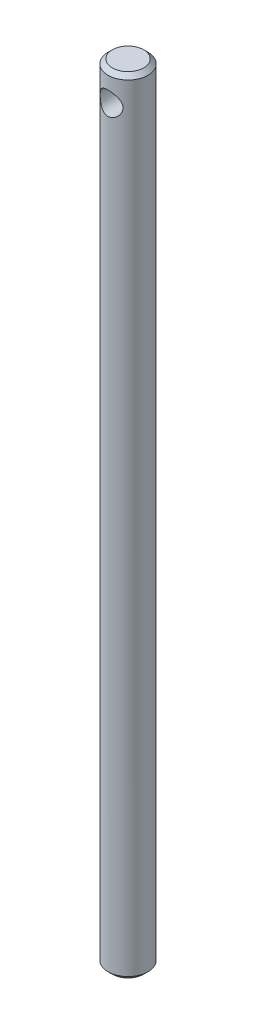
ISO-10303-21;
HEADER;
FILE_DESCRIPTION(('STEP AP214'),'2;1');
FILE_NAME('part.step','',(''),(''),'','','');
FILE_SCHEMA(('AUTOMOTIVE_DESIGN { 1 0 10303 214 1 1 1 1 }'));
ENDSEC;
DATA;
#1=APPLICATION_CONTEXT('core data for automotive mechanical design processes');
#2=APPLICATION_PROTOCOL_DEFINITION('international standard','automotive_design',2000,#1);
#3=PRODUCT_CONTEXT('',#1,'mechanical');
#4=PRODUCT('Part','Part','',(#3));
#5=PRODUCT_RELATED_PRODUCT_CATEGORY('part','',(#4));
#6=PRODUCT_DEFINITION_FORMATION('','',#4);
#7=PRODUCT_DEFINITION_CONTEXT('part definition',#1,'design');
#8=PRODUCT_DEFINITION('design','',#6,#7);
#9=PRODUCT_DEFINITION_SHAPE('','',#8);
#10=(LENGTH_UNIT() NAMED_UNIT(*) SI_UNIT(.MILLI.,.METRE.));
#11=(NAMED_UNIT(*) PLANE_ANGLE_UNIT() SI_UNIT($,.RADIAN.));
#12=(NAMED_UNIT(*) SI_UNIT($,.STERADIAN.) SOLID_ANGLE_UNIT());
#13=UNCERTAINTY_MEASURE_WITH_UNIT(LENGTH_MEASURE(1.E-05),#10,'distance_accuracy_value','');
#14=(GEOMETRIC_REPRESENTATION_CONTEXT(3) GLOBAL_UNCERTAINTY_ASSIGNED_CONTEXT((#13)) GLOBAL_UNIT_ASSIGNED_CONTEXT((#10,
#11,#12)) REPRESENTATION_CONTEXT('',''));
#15=CARTESIAN_POINT('',(0.,0.,0.));
#16=DIRECTION('',(0.,0.,1.));
#17=DIRECTION('',(1.,0.,0.));
#18=AXIS2_PLACEMENT_3D('',#15,#16,#17);
#19=CARTESIAN_POINT('',(0.,550.,0.));
#20=DIRECTION('',(0.,1.,0.));
#21=DIRECTION('',(0.,0.,1.));
#22=AXIS2_PLACEMENT_3D('',#19,#20,#21);
#23=PLANE('',#22);
#24=CARTESIAN_POINT('',(0.,550.,0.));
#25=DIRECTION('',(0.,-1.,0.));
#26=DIRECTION('',(0.,0.,-1.));
#27=AXIS2_PLACEMENT_3D('',#24,#25,#26);
#28=CIRCLE('',#27,11.);
#29=CARTESIAN_POINT('',(0.,550.,-11.));
#30=VERTEX_POINT('',#29);
#31=EDGE_CURVE('E17',#30,#30,#28,.T.);
#32=ORIENTED_EDGE('',*,*,#31,.F.);
#33=EDGE_LOOP('',(#32));
#34=FACE_BOUND('',#33,.T.);
#35=ADVANCED_FACE('F14',(#34),#23,.T.);
#36=CARTESIAN_POINT('',(0.,0.,0.));
#37=DIRECTION('',(0.,1.,0.));
#38=DIRECTION('',(0.,0.,1.));
#39=AXIS2_PLACEMENT_3D('',#36,#37,#38);
#40=PLANE('',#39);
#41=CARTESIAN_POINT('',(0.,0.,0.));
#42=DIRECTION('',(0.,1.,0.));
#43=DIRECTION('',(0.,0.,1.));
#44=AXIS2_PLACEMENT_3D('',#41,#42,#43);
#45=CIRCLE('',#44,11.0000000000001);
#46=CARTESIAN_POINT('',(0.,0.,11.0000000000001));
#47=VERTEX_POINT('',#46);
#48=EDGE_CURVE('E61',#47,#47,#45,.T.);
#49=ORIENTED_EDGE('',*,*,#48,.F.);
#50=EDGE_LOOP('',(#49));
#51=FACE_BOUND('',#50,.T.);
#52=ADVANCED_FACE('F71',(#51),#40,.F.);
#53=CARTESIAN_POINT('',(0.,547.,0.));
#54=DIRECTION('',(0.,-1.,0.));
#55=DIRECTION('',(0.,0.,-1.));
#56=AXIS2_PLACEMENT_3D('',#53,#54,#55);
#57=CONICAL_SURFACE('',#56,14.,0.785398163397464);
#58=CARTESIAN_POINT('',(0.,547.,0.));
#59=DIRECTION('',(0.,-1.,0.));
#60=DIRECTION('',(0.,0.,-1.));
#61=AXIS2_PLACEMENT_3D('',#58,#59,#60);
#62=CIRCLE('',#61,14.);
#63=CARTESIAN_POINT('',(0.,547.,-14.));
#64=VERTEX_POINT('',#63);
#65=EDGE_CURVE('E59',#64,#64,#62,.T.);
#66=ORIENTED_EDGE('',*,*,#65,.F.);
#67=EDGE_LOOP('',(#66));
#68=FACE_BOUND('',#67,.T.);
#69=ORIENTED_EDGE('',*,*,#31,.T.);
#70=EDGE_LOOP('',(#69));
#71=FACE_BOUND('',#70,.T.);
#72=ADVANCED_FACE('F68',(#68,#71),#57,.T.);
#73=CARTESIAN_POINT('',(0.,2.99999999999989,0.));
#74=DIRECTION('',(0.,1.,0.));
#75=DIRECTION('',(0.,0.,1.));
#76=AXIS2_PLACEMENT_3D('',#73,#74,#75);
#77=CONICAL_SURFACE('',#76,14.,0.785398163397446);
#78=CARTESIAN_POINT('',(0.,2.99999999999989,0.));
#79=DIRECTION('',(0.,-1.,0.));
#80=DIRECTION('',(0.,0.,-1.));
#81=AXIS2_PLACEMENT_3D('',#78,#79,#80);
#82=CIRCLE('',#81,14.);
#83=CARTESIAN_POINT('',(0.,2.99999999999989,-14.));
#84=VERTEX_POINT('',#83);
#85=EDGE_CURVE('E21',#84,#84,#82,.F.);
#86=ORIENTED_EDGE('',*,*,#85,.F.);
#87=EDGE_LOOP('',(#86));
#88=FACE_BOUND('',#87,.T.);
#89=ORIENTED_EDGE('',*,*,#48,.T.);
#90=EDGE_LOOP('',(#89));
#91=FACE_BOUND('',#90,.T.);
#92=ADVANCED_FACE('F50',(#88,#91),#77,.T.);
#93=CARTESIAN_POINT('',(0.,530.,-14.));
#94=DIRECTION('',(0.,0.,1.));
#95=DIRECTION('',(1.,0.,0.));
#96=AXIS2_PLACEMENT_3D('',#93,#94,#95);
#97=CYLINDRICAL_SURFACE('',#96,8.);
#98=CARTESIAN_POINT('',(0.,522.,-14.));
#99=CARTESIAN_POINT('',(0.206660351415308,522.000000401935,-13.9999996369652));
#100=CARTESIAN_POINT('',(0.413326886960815,522.008017552536,-13.9954138719592));
#101=CARTESIAN_POINT('',(0.825022790917126,522.039976615102,-13.9771886182609));
#102=CARTESIAN_POINT('',(1.03005209607585,522.063919139337,-13.9635487814735));
#103=CARTESIAN_POINT('',(1.43697755331769,522.127419793705,-13.9275566960707));
#104=CARTESIAN_POINT('',(1.63887244243906,522.166984056913,-13.9052010256738));
#105=CARTESIAN_POINT('',(2.03800016057408,522.261227097188,-13.8523314270015));
#106=CARTESIAN_POINT('',(2.23523298113957,522.315905901641,-13.8218174839436));
#107=CARTESIAN_POINT('',(2.62294064685338,522.439483584857,-13.753500277602));
#108=CARTESIAN_POINT('',(2.8134404380567,522.508321654604,-13.7157282294995));
#109=CARTESIAN_POINT('',(3.1875393686063,522.659677759771,-13.6336454630291));
#110=CARTESIAN_POINT('',(3.37113581956987,522.742201058339,-13.5893322297359));
#111=CARTESIAN_POINT('',(3.73040506921666,522.920152098035,-13.4951304198557));
#112=CARTESIAN_POINT('',(3.90608006334459,523.015576233996,-13.4452434015493));
#113=CARTESIAN_POINT('',(4.24884081181864,523.2186231883,-13.3408960284132));
#114=CARTESIAN_POINT('',(4.41592336902639,523.326250500234,-13.2864339908436));
#115=CARTESIAN_POINT('',(4.92655872863436,523.68263041309,-13.1097077842222));
#116=CARTESIAN_POINT('',(5.25370582547598,523.952168265511,-12.9810497459251));
#117=CARTESIAN_POINT('',(5.86077427051857,524.538342922238,-12.7185287074465));
#118=CARTESIAN_POINT('',(6.14064462310733,524.855029900716,-12.5846602760498));
#119=CARTESIAN_POINT('',(6.5350913421019,525.379671769084,-12.3821520208529));
#120=CARTESIAN_POINT('',(6.66778796607756,525.573271086446,-12.3110039238749));
#121=CARTESIAN_POINT('',(6.91631724684709,525.972612427536,-12.1731151242106));
#122=CARTESIAN_POINT('',(7.03214758855266,526.178356112778,-12.1063750272578));
#123=CARTESIAN_POINT('',(7.24574677515028,526.600720635624,-11.9797565125425));
#124=CARTESIAN_POINT('',(7.34353647295364,526.817328542226,-11.9198702033875));
#125=CARTESIAN_POINT('',(7.52007317185402,527.260416114236,-11.80929135623));
#126=CARTESIAN_POINT('',(7.59882604515646,527.486892709986,-11.7585959843489));
#127=CARTESIAN_POINT('',(7.7219361291731,527.900438989525,-11.678010765477));
#128=CARTESIAN_POINT('',(7.77003796991308,528.085985088977,-11.6459863513988));
#129=CARTESIAN_POINT('',(7.85296717401767,528.461231934925,-11.5902291384266));
#130=CARTESIAN_POINT('',(7.88779718770753,528.650931843914,-11.5664946841432));
#131=CARTESIAN_POINT('',(7.9436994072274,529.033098467647,-11.5281738684785));
#132=CARTESIAN_POINT('',(7.96478377061683,529.225562583111,-11.5135794235215));
#133=CARTESIAN_POINT('',(7.9929346273541,529.612016008331,-11.4940546039595));
#134=CARTESIAN_POINT('',(8.00000039196159,529.806005396852,-11.4891247317562));
#135=CARTESIAN_POINT('',(7.99999958875113,530.203540509715,-11.4891258820169));
#136=CARTESIAN_POINT('',(7.99222050163183,530.407086759878,-11.4945540671202));
#137=CARTESIAN_POINT('',(7.96123584536698,530.812433877569,-11.5160354647514));
#138=CARTESIAN_POINT('',(7.93802954156052,531.014234661513,-11.5320891832786));
#139=CARTESIAN_POINT('',(7.876546101919,531.414591647703,-11.5741696486487));
#140=CARTESIAN_POINT('',(7.83825916326066,531.613145651844,-11.6002028821528));
#141=CARTESIAN_POINT('',(7.74715022464587,532.005557738527,-11.6612462177271));
#142=CARTESIAN_POINT('',(7.69432152378681,532.199413611235,-11.696260457773));
#143=CARTESIAN_POINT('',(7.57521092181331,532.579852103483,-11.7737497524104));
#144=CARTESIAN_POINT('',(7.50902546776178,532.766476035904,-11.8161710414763));
#145=CARTESIAN_POINT('',(7.36362327110631,533.133042546459,-11.9073261605518));
#146=CARTESIAN_POINT('',(7.28440168722587,533.312982611836,-11.956062334309));
#147=CARTESIAN_POINT('',(7.11357824930081,533.665425068102,-12.0584785471534));
#148=CARTESIAN_POINT('',(7.0219764157498,533.837927471302,-12.1121585780568));
#149=CARTESIAN_POINT('',(6.82702893746685,534.174877950623,-12.2231049448853));
#150=CARTESIAN_POINT('',(6.72368289286599,534.339325752226,-12.280371402892));
#151=CARTESIAN_POINT('',(6.37279899505729,534.855113739692,-12.4684579924012));
#152=CARTESIAN_POINT('',(6.10294933761409,535.19013159367,-12.6039118777351));
#153=CARTESIAN_POINT('',(5.66071475646066,535.657070636402,-12.8055754505049));
#154=CARTESIAN_POINT('',(5.50693994227962,535.80687741698,-12.8725898159577));
#155=CARTESIAN_POINT('',(5.18729629807651,536.094102005691,-13.004684213942));
#156=CARTESIAN_POINT('',(5.02142543252271,536.231517719906,-13.0697639183015));
#157=CARTESIAN_POINT('',(4.66189813332208,536.505580540916,-13.202532354961));
#158=CARTESIAN_POINT('',(4.467101026017,536.640900534196,-13.2698765441686));
#159=CARTESIAN_POINT('',(4.06489166889871,536.894427340569,-13.3985523685816));
#160=CARTESIAN_POINT('',(3.85748474084275,537.01264130274,-13.4598865120696));
#161=CARTESIAN_POINT('',(3.43137756707665,537.230689989381,-13.5747669218615));
#162=CARTESIAN_POINT('',(3.2126868917706,537.33053997165,-13.6283196455553));
#163=CARTESIAN_POINT('',(2.76540722516245,537.510699557076,-13.7260655742452));
#164=CARTESIAN_POINT('',(2.53682090747897,537.591014399928,-13.7702612885556));
#165=CARTESIAN_POINT('',(2.1191852043533,537.71663266865,-13.839952596457));
#166=CARTESIAN_POINT('',(1.93159910848646,537.765736700106,-13.8674239603899));
#167=CARTESIAN_POINT('',(1.55247099087272,537.850320918507,-13.9149671453008));
#168=CARTESIAN_POINT('',(1.36092961296443,537.88580330464,-13.935040160706));
#169=CARTESIAN_POINT('',(0.975191912995078,537.942732200054,-13.967334939402));
#170=CARTESIAN_POINT('',(0.780996672844437,537.964184264552,-13.9795598100807));
#171=CARTESIAN_POINT('',(0.391202865526867,537.992818845132,-13.9958927911288));
#172=CARTESIAN_POINT('',(0.195604202832928,538.000000380432,-14.0000003436127));
#173=CARTESIAN_POINT('',(-0.206660351415321,537.999999598065,-13.9999996369652));
#174=CARTESIAN_POINT('',(-0.413326886960826,537.991982447464,-13.9954138719592));
#175=CARTESIAN_POINT('',(-0.825022790917135,537.960023384898,-13.9771886182609));
#176=CARTESIAN_POINT('',(-1.03005209607585,537.936080860663,-13.9635487814735));
#177=CARTESIAN_POINT('',(-1.4369775533177,537.872580206295,-13.9275566960707));
#178=CARTESIAN_POINT('',(-1.63887244243907,537.833015943087,-13.9052010256738));
#179=CARTESIAN_POINT('',(-2.03800016057409,537.738772902812,-13.8523314270015));
#180=CARTESIAN_POINT('',(-2.23523298113958,537.684094098359,-13.8218174839436));
#181=CARTESIAN_POINT('',(-2.62294064685341,537.560516415143,-13.753500277602));
#182=CARTESIAN_POINT('',(-2.81344043805674,537.491678345396,-13.7157282294995));
#183=CARTESIAN_POINT('',(-3.18753936860635,537.340322240228,-13.633645463029));
#184=CARTESIAN_POINT('',(-3.37113581956991,537.257798941661,-13.5893322297359));
#185=CARTESIAN_POINT('',(-3.73040506921669,537.079847901965,-13.4951304198557));
#186=CARTESIAN_POINT('',(-3.90608006334462,536.984423766004,-13.4452434015493));
#187=CARTESIAN_POINT('',(-4.24884081181866,536.7813768117,-13.3408960284132));
#188=CARTESIAN_POINT('',(-4.4159233690264,536.673749499766,-13.2864339908436));
#189=CARTESIAN_POINT('',(-4.92655872863436,536.31736958691,-13.1097077842222));
#190=CARTESIAN_POINT('',(-5.25370582547598,536.04783173449,-12.9810497459251));
#191=CARTESIAN_POINT('',(-5.86077427051857,535.461657077763,-12.7185287074465));
#192=CARTESIAN_POINT('',(-6.14064462310733,535.144970099284,-12.5846602760498));
#193=CARTESIAN_POINT('',(-6.5350913421019,534.620328230916,-12.3821520208529));
#194=CARTESIAN_POINT('',(-6.66778796607756,534.426728913554,-12.3110039238749));
#195=CARTESIAN_POINT('',(-6.91631724684709,534.027387572464,-12.1731151242106));
#196=CARTESIAN_POINT('',(-7.03214758855266,533.821643887222,-12.1063750272578));
#197=CARTESIAN_POINT('',(-7.24574677515028,533.399279364376,-11.9797565125425));
#198=CARTESIAN_POINT('',(-7.34353647295363,533.182671457774,-11.9198702033875));
#199=CARTESIAN_POINT('',(-7.52007317185401,532.739583885764,-11.80929135623));
#200=CARTESIAN_POINT('',(-7.59882604515646,532.513107290014,-11.7585959843489));
#201=CARTESIAN_POINT('',(-7.72193612917311,532.099561010475,-11.678010765477));
#202=CARTESIAN_POINT('',(-7.7700379699131,531.914014911023,-11.6459863513988));
#203=CARTESIAN_POINT('',(-7.85296717401768,531.538768065075,-11.5902291384266));
#204=CARTESIAN_POINT('',(-7.88779718770754,531.349068156086,-11.5664946841432));
#205=CARTESIAN_POINT('',(-7.94369940722741,530.966901532353,-11.5281738684785));
#206=CARTESIAN_POINT('',(-7.96478377061685,530.774437416889,-11.5135794235215));
#207=CARTESIAN_POINT('',(-7.9929346273541,530.387983991668,-11.4940546039595));
#208=CARTESIAN_POINT('',(-8.00000039196159,530.193994603148,-11.4891247317562));
#209=CARTESIAN_POINT('',(-7.99999958875113,529.796459490285,-11.4891258820169));
#210=CARTESIAN_POINT('',(-7.99222050163183,529.592913240122,-11.4945540671202));
#211=CARTESIAN_POINT('',(-7.96123584536698,529.187566122431,-11.5160354647514));
#212=CARTESIAN_POINT('',(-7.93802954156052,528.985765338487,-11.5320891832786));
#213=CARTESIAN_POINT('',(-7.876546101919,528.585408352297,-11.5741696486487));
#214=CARTESIAN_POINT('',(-7.83825916326066,528.386854348156,-11.6002028821528));
#215=CARTESIAN_POINT('',(-7.74715022464587,527.994442261473,-11.6612462177271));
#216=CARTESIAN_POINT('',(-7.69432152378681,527.800586388765,-11.696260457773));
#217=CARTESIAN_POINT('',(-7.57521092181331,527.420147896517,-11.7737497524104));
#218=CARTESIAN_POINT('',(-7.50902546776178,527.233523964097,-11.8161710414763));
#219=CARTESIAN_POINT('',(-7.36362327110631,526.866957453541,-11.9073261605518));
#220=CARTESIAN_POINT('',(-7.28440168722588,526.687017388164,-11.956062334309));
#221=CARTESIAN_POINT('',(-7.1135782493008,526.334574931898,-12.0584785471534));
#222=CARTESIAN_POINT('',(-7.02197641574976,526.162072528698,-12.1121585780568));
#223=CARTESIAN_POINT('',(-6.82702893746681,525.825122049377,-12.2231049448853));
#224=CARTESIAN_POINT('',(-6.72368289286598,525.660674247774,-12.280371402892));
#225=CARTESIAN_POINT('',(-6.37279899505732,525.144886260308,-12.4684579924012));
#226=CARTESIAN_POINT('',(-6.10294933761406,524.80986840633,-12.6039118777351));
#227=CARTESIAN_POINT('',(-5.66071475646069,524.342929363598,-12.8055754505049));
#228=CARTESIAN_POINT('',(-5.50693994227968,524.19312258302,-12.8725898159577));
#229=CARTESIAN_POINT('',(-5.18729629807656,523.905897994309,-13.0046842139419));
#230=CARTESIAN_POINT('',(-5.02142543252273,523.768482280094,-13.0697639183015));
#231=CARTESIAN_POINT('',(-4.66189813332204,523.494419459084,-13.202532354961));
#232=CARTESIAN_POINT('',(-4.46710102601696,523.359099465804,-13.2698765441686));
#233=CARTESIAN_POINT('',(-4.06489166889866,523.105572659431,-13.3985523685817));
#234=CARTESIAN_POINT('',(-3.8574847408427,522.98735869726,-13.4598865120696));
#235=CARTESIAN_POINT('',(-3.43137756707659,522.769310010619,-13.5747669218615));
#236=CARTESIAN_POINT('',(-3.21268689177055,522.669460028351,-13.6283196455553));
#237=CARTESIAN_POINT('',(-2.76540722516243,522.489300442924,-13.7260655742452));
#238=CARTESIAN_POINT('',(-2.53682090747896,522.408985600072,-13.7702612885556));
#239=CARTESIAN_POINT('',(-2.11918520435331,522.28336733135,-13.839952596457));
#240=CARTESIAN_POINT('',(-1.93159910848646,522.234263299894,-13.8674239603899));
#241=CARTESIAN_POINT('',(-1.55247099087273,522.149679081493,-13.9149671453008));
#242=CARTESIAN_POINT('',(-1.36092961296443,522.11419669536,-13.935040160706));
#243=CARTESIAN_POINT('',(-0.975191912995085,522.057267799946,-13.967334939402));
#244=CARTESIAN_POINT('',(-0.780996672844445,522.035815735448,-13.9795598100807));
#245=CARTESIAN_POINT('',(-0.391202865526878,522.007181154868,-13.9958927911288));
#246=CARTESIAN_POINT('',(-0.195604202832941,521.999999619568,-14.0000003436127));
#247=CARTESIAN_POINT('',(0.,522.,-14.));
#248=B_SPLINE_CURVE_WITH_KNOTS('',3,(#98,#99,#100,#101,#102,#103,#104,#105,#106,#107,#108,#109,
#110,#111,#112,#113,#114,#115,#116,#117,#118,#119,#120,#121,#122,#123,#124,#125,#126,#127,#128,
#129,#130,#131,#132,#133,#134,#135,#136,#137,#138,#139,#140,#141,#142,#143,#144,#145,#146,#147,
#148,#149,#150,#151,#152,#153,#154,#155,#156,#157,#158,#159,#160,#161,#162,#163,#164,#165,#166,
#167,#168,#169,#170,#171,#172,#173,#174,#175,#176,#177,#178,#179,#180,#181,#182,#183,#184,#185,
#186,#187,#188,#189,#190,#191,#192,#193,#194,#195,#196,#197,#198,#199,#200,#201,#202,#203,#204,
#205,#206,#207,#208,#209,#210,#211,#212,#213,#214,#215,#216,#217,#218,#219,#220,#221,#222,#223,
#224,#225,#226,#227,#228,#229,#230,#231,#232,#233,#234,#235,#236,#237,#238,#239,#240,#241,#242,
#243,#244,#245,#246,#247),.UNSPECIFIED.,.T.,.F.,(4,2,2,2,2,2,2,2,2,2,2,2,2,2,2,2,2,2,2,2,2,2,2,
2,2,2,2,2,2,2,2,2,2,2,2,2,2,2,2,2,2,2,2,2,2,2,2,2,2,2,2,2,2,2,2,2,2,2,2,2,2,2,2,2,2,2,2,2,2,2,2,
2,2,2,4),(0.,0.619787122467361,1.23959807480147,1.85965260644637,2.47970826161051,
3.09715460726852,3.71483896720886,4.33235106926194,4.95009130161897,6.27338623089156,
7.59809955720683,8.33309045394215,9.06818214159527,9.80241874991364,10.5364285816537,
11.1188160356825,11.7010871284826,12.282842521125,12.8646281548437,13.4750417566164,
14.0854844290335,14.6963245623966,15.3074466459281,15.9143043940274,16.5213880239186,
17.1284706488876,17.735573950107,19.0821148547345,19.7563231944973,20.4306452534791,
21.1693761967511,21.9077975069025,22.6456024969793,23.3832093750078,23.970125398674,
24.5569466260657,25.143535364413,25.7301644163143,26.3499515387816,26.9697624911157,
27.5898170227606,28.2098726779248,28.8273190235829,29.4450033835232,30.0625154855762,
30.6802557179332,32.0035506472058,33.3282639735211,34.0632548702564,34.7983465579095,
35.5325831662279,36.266592997968,36.8489804519969,37.4312515447969,38.0130069374394,
38.594792571158,39.2052061729306,39.8156488453478,40.4264889787109,41.0376110622423,
41.6444688103416,42.2515524402328,42.8586350652019,43.4657383664213,44.8122792710486,
45.4864876108115,46.1608096697934,46.8995406130655,47.6379619232168,48.3757669132936,
49.1133737913221,49.7002898149883,50.2871110423799,50.8736997807272,51.4603288326285),.UNSPECIFIED.);
#249=CARTESIAN_POINT('',(0.,522.,-14.));
#250=VERTEX_POINT('',#249);
#251=EDGE_CURVE('E10',#250,#250,#248,.T.);
#252=ORIENTED_EDGE('',*,*,#251,.F.);
#253=EDGE_LOOP('',(#252));
#254=FACE_BOUND('',#253,.T.);
#255=CARTESIAN_POINT('',(0.,538.,14.));
#256=CARTESIAN_POINT('',(0.206660351415307,537.999999598065,13.9999996369652));
#257=CARTESIAN_POINT('',(0.413326886960811,537.991982447464,13.9954138719592));
#258=CARTESIAN_POINT('',(0.825022790917123,537.960023384898,13.9771886182609));
#259=CARTESIAN_POINT('',(1.03005209607585,537.936080860663,13.9635487814735));
#260=CARTESIAN_POINT('',(1.43697755331769,537.872580206295,13.9275566960707));
#261=CARTESIAN_POINT('',(1.63887244243906,537.833015943087,13.9052010256738));
#262=CARTESIAN_POINT('',(2.03800016057409,537.738772902812,13.8523314270015));
#263=CARTESIAN_POINT('',(2.23523298113958,537.684094098359,13.8218174839436));
#264=CARTESIAN_POINT('',(2.62294064685341,537.560516415143,13.753500277602));
#265=CARTESIAN_POINT('',(2.81344043805674,537.491678345396,13.7157282294995));
#266=CARTESIAN_POINT('',(3.18753936860635,537.340322240228,13.633645463029));
#267=CARTESIAN_POINT('',(3.37113581956991,537.257798941661,13.5893322297359));
#268=CARTESIAN_POINT('',(3.73040506921669,537.079847901965,13.4951304198557));
#269=CARTESIAN_POINT('',(3.90608006334462,536.984423766004,13.4452434015493));
#270=CARTESIAN_POINT('',(4.24884081181866,536.7813768117,13.3408960284132));
#271=CARTESIAN_POINT('',(4.4159233690264,536.673749499766,13.2864339908436));
#272=CARTESIAN_POINT('',(4.92655872863436,536.31736958691,13.1097077842222));
#273=CARTESIAN_POINT('',(5.25370582547598,536.04783173449,12.9810497459251));
#274=CARTESIAN_POINT('',(5.86077427051857,535.461657077763,12.7185287074465));
#275=CARTESIAN_POINT('',(6.14064462310733,535.144970099284,12.5846602760498));
#276=CARTESIAN_POINT('',(6.53509134210193,534.620328230916,12.3821520208529));
#277=CARTESIAN_POINT('',(6.66778796607763,534.426728913554,12.3110039238749));
#278=CARTESIAN_POINT('',(6.91631724684718,534.027387572464,12.1731151242105));
#279=CARTESIAN_POINT('',(7.03214758855273,533.821643887222,12.1063750272578));
#280=CARTESIAN_POINT('',(7.24574677515032,533.399279364376,11.9797565125424));
#281=CARTESIAN_POINT('',(7.34353647295365,533.182671457774,11.9198702033875));
#282=CARTESIAN_POINT('',(7.52007317185401,532.739583885764,11.80929135623));
#283=CARTESIAN_POINT('',(7.59882604515646,532.513107290014,11.7585959843489));
#284=CARTESIAN_POINT('',(7.72193612917311,532.099561010475,11.678010765477));
#285=CARTESIAN_POINT('',(7.7700379699131,531.914014911023,11.6459863513988));
#286=CARTESIAN_POINT('',(7.85296717401768,531.538768065075,11.5902291384266));
#287=CARTESIAN_POINT('',(7.88779718770754,531.349068156086,11.5664946841432));
#288=CARTESIAN_POINT('',(7.94369940722742,530.966901532353,11.5281738684785));
#289=CARTESIAN_POINT('',(7.96478377061687,530.774437416889,11.5135794235215));
#290=CARTESIAN_POINT('',(7.99293462735411,530.387983991668,11.4940546039595));
#291=CARTESIAN_POINT('',(8.00000039196159,530.193994603148,11.4891247317562));
#292=CARTESIAN_POINT('',(7.99999958875113,529.796459490285,11.4891258820169));
#293=CARTESIAN_POINT('',(7.99222050163183,529.592913240122,11.4945540671202));
#294=CARTESIAN_POINT('',(7.96123584536696,529.18756612243,11.5160354647514));
#295=CARTESIAN_POINT('',(7.93802954156051,528.985765338487,11.5320891832786));
#296=CARTESIAN_POINT('',(7.876546101919,528.585408352297,11.5741696486487));
#297=CARTESIAN_POINT('',(7.83825916326066,528.386854348156,11.6002028821528));
#298=CARTESIAN_POINT('',(7.74715022464587,527.994442261473,11.6612462177271));
#299=CARTESIAN_POINT('',(7.69432152378681,527.800586388765,11.696260457773));
#300=CARTESIAN_POINT('',(7.57521092181331,527.420147896517,11.7737497524104));
#301=CARTESIAN_POINT('',(7.50902546776178,527.233523964097,11.8161710414763));
#302=CARTESIAN_POINT('',(7.36362327110631,526.866957453541,11.9073261605518));
#303=CARTESIAN_POINT('',(7.28440168722588,526.687017388164,11.956062334309));
#304=CARTESIAN_POINT('',(7.1135782493008,526.334574931898,12.0584785471534));
#305=CARTESIAN_POINT('',(7.02197641574976,526.162072528698,12.1121585780568));
#306=CARTESIAN_POINT('',(6.82702893746681,525.825122049377,12.2231049448853));
#307=CARTESIAN_POINT('',(6.72368289286598,525.660674247774,12.280371402892));
#308=CARTESIAN_POINT('',(6.37279899505732,525.144886260308,12.4684579924012));
#309=CARTESIAN_POINT('',(6.10294933761407,524.80986840633,12.6039118777351));
#310=CARTESIAN_POINT('',(5.66071475646072,524.342929363598,12.8055754505049));
#311=CARTESIAN_POINT('',(5.50693994227974,524.19312258302,12.8725898159577));
#312=CARTESIAN_POINT('',(5.18729629807663,523.905897994309,13.0046842139419));
#313=CARTESIAN_POINT('',(5.02142543252277,523.768482280094,13.0697639183015));
#314=CARTESIAN_POINT('',(4.66189813332207,523.494419459084,13.202532354961));
#315=CARTESIAN_POINT('',(4.467101026017,523.359099465804,13.2698765441686));
#316=CARTESIAN_POINT('',(4.06489166889872,523.105572659431,13.3985523685816));
#317=CARTESIAN_POINT('',(3.85748474084275,522.98735869726,13.4598865120696));
#318=CARTESIAN_POINT('',(3.43137756707665,522.769310010619,13.5747669218615));
#319=CARTESIAN_POINT('',(3.2126868917706,522.669460028351,13.6283196455553));
#320=CARTESIAN_POINT('',(2.76540722516245,522.489300442924,13.7260655742452));
#321=CARTESIAN_POINT('',(2.53682090747897,522.408985600072,13.7702612885556));
#322=CARTESIAN_POINT('',(2.11918520435332,522.28336733135,13.839952596457));
#323=CARTESIAN_POINT('',(1.93159910848649,522.234263299894,13.8674239603899));
#324=CARTESIAN_POINT('',(1.55247099087276,522.149679081493,13.9149671453008));
#325=CARTESIAN_POINT('',(1.36092961296444,522.11419669536,13.935040160706));
#326=CARTESIAN_POINT('',(0.975191912995077,522.057267799946,13.967334939402));
#327=CARTESIAN_POINT('',(0.780996672844436,522.035815735448,13.9795598100807));
#328=CARTESIAN_POINT('',(0.391202865526867,522.007181154868,13.9958927911288));
#329=CARTESIAN_POINT('',(0.195604202832929,521.999999619568,14.0000003436127));
#330=CARTESIAN_POINT('',(-0.20666035141532,522.000000401935,13.9999996369652));
#331=CARTESIAN_POINT('',(-0.413326886960826,522.008017552536,13.9954138719592));
#332=CARTESIAN_POINT('',(-0.825022790917135,522.039976615102,13.9771886182609));
#333=CARTESIAN_POINT('',(-1.03005209607585,522.063919139337,13.9635487814735));
#334=CARTESIAN_POINT('',(-1.43697755331769,522.127419793705,13.9275566960707));
#335=CARTESIAN_POINT('',(-1.63887244243906,522.166984056913,13.9052010256738));
#336=CARTESIAN_POINT('',(-2.03800016057409,522.261227097188,13.8523314270015));
#337=CARTESIAN_POINT('',(-2.23523298113958,522.315905901641,13.8218174839436));
#338=CARTESIAN_POINT('',(-2.6229406468534,522.439483584857,13.753500277602));
#339=CARTESIAN_POINT('',(-2.81344043805673,522.508321654604,13.7157282294995));
#340=CARTESIAN_POINT('',(-3.18753936860635,522.659677759772,13.633645463029));
#341=CARTESIAN_POINT('',(-3.37113581956991,522.742201058339,13.5893322297359));
#342=CARTESIAN_POINT('',(-3.73040506921671,522.920152098035,13.4951304198557));
#343=CARTESIAN_POINT('',(-3.90608006334466,523.015576233996,13.4452434015493));
#344=CARTESIAN_POINT('',(-4.24884081181869,523.2186231883,13.3408960284132));
#345=CARTESIAN_POINT('',(-4.41592336902641,523.326250500234,13.2864339908436));
#346=CARTESIAN_POINT('',(-4.92655872863435,523.68263041309,13.1097077842222));
#347=CARTESIAN_POINT('',(-5.25370582547598,523.952168265511,12.9810497459251));
#348=CARTESIAN_POINT('',(-5.86077427051857,524.538342922238,12.7185287074465));
#349=CARTESIAN_POINT('',(-6.14064462310733,524.855029900716,12.5846602760498));
#350=CARTESIAN_POINT('',(-6.5350913421019,525.379671769084,12.3821520208529));
#351=CARTESIAN_POINT('',(-6.66778796607756,525.573271086446,12.3110039238749));
#352=CARTESIAN_POINT('',(-6.91631724684711,525.972612427536,12.1731151242106));
#353=CARTESIAN_POINT('',(-7.0321475885527,526.178356112778,12.1063750272578));
#354=CARTESIAN_POINT('',(-7.24574677515032,526.600720635624,11.9797565125424));
#355=CARTESIAN_POINT('',(-7.34353647295365,526.817328542226,11.9198702033875));
#356=CARTESIAN_POINT('',(-7.52007317185401,527.260416114236,11.80929135623));
#357=CARTESIAN_POINT('',(-7.59882604515645,527.486892709986,11.7585959843489));
#358=CARTESIAN_POINT('',(-7.7219361291731,527.900438989525,11.678010765477));
#359=CARTESIAN_POINT('',(-7.77003796991308,528.085985088977,11.6459863513988));
#360=CARTESIAN_POINT('',(-7.85296717401767,528.461231934925,11.5902291384266));
#361=CARTESIAN_POINT('',(-7.88779718770753,528.650931843914,11.5664946841432));
#362=CARTESIAN_POINT('',(-7.94369940722741,529.033098467647,11.5281738684785));
#363=CARTESIAN_POINT('',(-7.96478377061685,529.225562583111,11.5135794235215));
#364=CARTESIAN_POINT('',(-7.9929346273541,529.612016008332,11.4940546039595));
#365=CARTESIAN_POINT('',(-8.00000039196159,529.806005396852,11.4891247317562));
#366=CARTESIAN_POINT('',(-7.99999958875113,530.203540509715,11.4891258820169));
#367=CARTESIAN_POINT('',(-7.99222050163183,530.407086759878,11.4945540671202));
#368=CARTESIAN_POINT('',(-7.96123584536698,530.812433877569,11.5160354647514));
#369=CARTESIAN_POINT('',(-7.93802954156052,531.014234661513,11.5320891832786));
#370=CARTESIAN_POINT('',(-7.876546101919,531.414591647703,11.5741696486487));
#371=CARTESIAN_POINT('',(-7.83825916326066,531.613145651844,11.6002028821528));
#372=CARTESIAN_POINT('',(-7.74715022464587,532.005557738527,11.6612462177271));
#373=CARTESIAN_POINT('',(-7.69432152378681,532.199413611235,11.696260457773));
#374=CARTESIAN_POINT('',(-7.57521092181331,532.579852103483,11.7737497524104));
#375=CARTESIAN_POINT('',(-7.50902546776178,532.766476035904,11.8161710414763));
#376=CARTESIAN_POINT('',(-7.36362327110631,533.133042546459,11.9073261605518));
#377=CARTESIAN_POINT('',(-7.28440168722587,533.312982611836,11.956062334309));
#378=CARTESIAN_POINT('',(-7.11357824930081,533.665425068102,12.0584785471534));
#379=CARTESIAN_POINT('',(-7.0219764157498,533.837927471302,12.1121585780568));
#380=CARTESIAN_POINT('',(-6.82702893746685,534.174877950623,12.2231049448853));
#381=CARTESIAN_POINT('',(-6.72368289286599,534.339325752226,12.280371402892));
#382=CARTESIAN_POINT('',(-6.37279899505728,534.855113739692,12.4684579924012));
#383=CARTESIAN_POINT('',(-6.10294933761407,535.19013159367,12.6039118777351));
#384=CARTESIAN_POINT('',(-5.66071475646068,535.657070636402,12.8055754505049));
#385=CARTESIAN_POINT('',(-5.50693994227966,535.80687741698,12.8725898159577));
#386=CARTESIAN_POINT('',(-5.18729629807655,536.094102005691,13.0046842139419));
#387=CARTESIAN_POINT('',(-5.02142543252273,536.231517719906,13.0697639183015));
#388=CARTESIAN_POINT('',(-4.66189813332207,536.505580540916,13.202532354961));
#389=CARTESIAN_POINT('',(-4.467101026017,536.640900534196,13.2698765441686));
#390=CARTESIAN_POINT('',(-4.06489166889871,536.894427340569,13.3985523685816));
#391=CARTESIAN_POINT('',(-3.85748474084275,537.01264130274,13.4598865120696));
#392=CARTESIAN_POINT('',(-3.43137756707665,537.230689989381,13.5747669218615));
#393=CARTESIAN_POINT('',(-3.2126868917706,537.33053997165,13.6283196455553));
#394=CARTESIAN_POINT('',(-2.76540722516245,537.510699557076,13.7260655742452));
#395=CARTESIAN_POINT('',(-2.53682090747897,537.591014399928,13.7702612885556));
#396=CARTESIAN_POINT('',(-2.1191852043533,537.71663266865,13.839952596457));
#397=CARTESIAN_POINT('',(-1.93159910848646,537.765736700106,13.8674239603899));
#398=CARTESIAN_POINT('',(-1.55247099087273,537.850320918507,13.9149671453008));
#399=CARTESIAN_POINT('',(-1.36092961296443,537.88580330464,13.935040160706));
#400=CARTESIAN_POINT('',(-0.975191912995083,537.942732200054,13.967334939402));
#401=CARTESIAN_POINT('',(-0.780996672844442,537.964184264552,13.9795598100807));
#402=CARTESIAN_POINT('',(-0.391202865526874,537.992818845132,13.9958927911288));
#403=CARTESIAN_POINT('',(-0.195604202832938,538.000000380432,14.0000003436127));
#404=CARTESIAN_POINT('',(0.,538.,14.));
#405=B_SPLINE_CURVE_WITH_KNOTS('',3,(#255,#256,#257,#258,#259,#260,#261,#262,#263,#264,#265,
#266,#267,#268,#269,#270,#271,#272,#273,#274,#275,#276,#277,#278,#279,#280,#281,#282,#283,#284,
#285,#286,#287,#288,#289,#290,#291,#292,#293,#294,#295,#296,#297,#298,#299,#300,#301,#302,#303,
#304,#305,#306,#307,#308,#309,#310,#311,#312,#313,#314,#315,#316,#317,#318,#319,#320,#321,#322,
#323,#324,#325,#326,#327,#328,#329,#330,#331,#332,#333,#334,#335,#336,#337,#338,#339,#340,#341,
#342,#343,#344,#345,#346,#347,#348,#349,#350,#351,#352,#353,#354,#355,#356,#357,#358,#359,#360,
#361,#362,#363,#364,#365,#366,#367,#368,#369,#370,#371,#372,#373,#374,#375,#376,#377,#378,#379,
#380,#381,#382,#383,#384,#385,#386,#387,#388,#389,#390,#391,#392,#393,#394,#395,#396,#397,#398,
#399,#400,#401,#402,#403,#404),.UNSPECIFIED.,.T.,.F.,(4,2,2,2,2,2,2,2,2,2,2,2,2,2,2,2,2,2,2,2,2,
2,2,2,2,2,2,2,2,2,2,2,2,2,2,2,2,2,2,2,2,2,2,2,2,2,2,2,2,2,2,2,2,2,2,2,2,2,2,2,2,2,2,2,2,2,2,2,2,
2,2,2,2,2,4),(0.,0.619787122467352,1.23959807480147,1.85965260644637,2.47970826161052,
3.09715460726861,3.71483896720894,4.33235106926194,4.95009130161895,6.27338623089155,
7.59809955720682,8.33309045394229,9.06818214159528,9.80241874991363,10.5364285816537,
11.1188160356826,11.7010871284826,12.2828425211254,12.8646281548437,13.4750417566166,
14.0854844290335,14.6963245623966,15.3074466459281,15.9143043940274,16.5213880239186,
17.1284706488876,17.735573950107,19.0821148547343,19.7563231944971,20.4306452534791,
21.1693761967511,21.9077975069025,22.6456024969793,23.3832093750078,23.970125398674,
24.5569466260656,25.143535364413,25.7301644163142,26.3499515387816,26.9697624911157,
27.5898170227606,28.2098726779247,28.8273190235828,29.4450033835232,30.0625154855762,
30.6802557179332,32.0035506472058,33.3282639735211,34.0632548702564,34.7983465579095,
35.5325831662279,36.266592997968,36.8489804519968,37.4312515447969,38.0130069374394,
38.594792571158,39.2052061729306,39.8156488453478,40.4264889787109,41.0376110622423,
41.6444688103416,42.2515524402328,42.8586350652019,43.4657383664213,44.8122792710487,
45.4864876108115,46.1608096697934,46.8995406130654,47.6379619232167,48.3757669132935,
49.1133737913221,49.7002898149883,50.2871110423799,50.8736997807272,51.4603288326285),.UNSPECIFIED.);
#406=CARTESIAN_POINT('',(0.,538.,14.));
#407=VERTEX_POINT('',#406);
#408=EDGE_CURVE('E26',#407,#407,#405,.T.);
#409=ORIENTED_EDGE('',*,*,#408,.F.);
#410=EDGE_LOOP('',(#409));
#411=FACE_BOUND('',#410,.T.);
#412=ADVANCED_FACE('F38',(#254,#411),#97,.F.);
#413=CARTESIAN_POINT('',(0.,550.,0.));
#414=DIRECTION('',(0.,-1.,0.));
#415=DIRECTION('',(0.,0.,-1.));
#416=AXIS2_PLACEMENT_3D('',#413,#414,#415);
#417=CYLINDRICAL_SURFACE('',#416,14.);
#418=ORIENTED_EDGE('',*,*,#408,.T.);
#419=EDGE_LOOP('',(#418));
#420=FACE_BOUND('',#419,.T.);
#421=ORIENTED_EDGE('',*,*,#85,.T.);
#422=EDGE_LOOP('',(#421));
#423=FACE_BOUND('',#422,.T.);
#424=ORIENTED_EDGE('',*,*,#251,.T.);
#425=EDGE_LOOP('',(#424));
#426=FACE_BOUND('',#425,.T.);
#427=ORIENTED_EDGE('',*,*,#65,.T.);
#428=EDGE_LOOP('',(#427));
#429=FACE_BOUND('',#428,.T.);
#430=ADVANCED_FACE('F41',(#420,#423,#426,#429),#417,.T.);
#431=CLOSED_SHELL('',(#35,#52,#72,#92,#412,#430));
#432=MANIFOLD_SOLID_BREP('B1',#431);
#433=ADVANCED_BREP_SHAPE_REPRESENTATION('',(#18,#432),#14);
#434=SHAPE_DEFINITION_REPRESENTATION(#9,#433);
ENDSEC;
END-ISO-10303-21;
